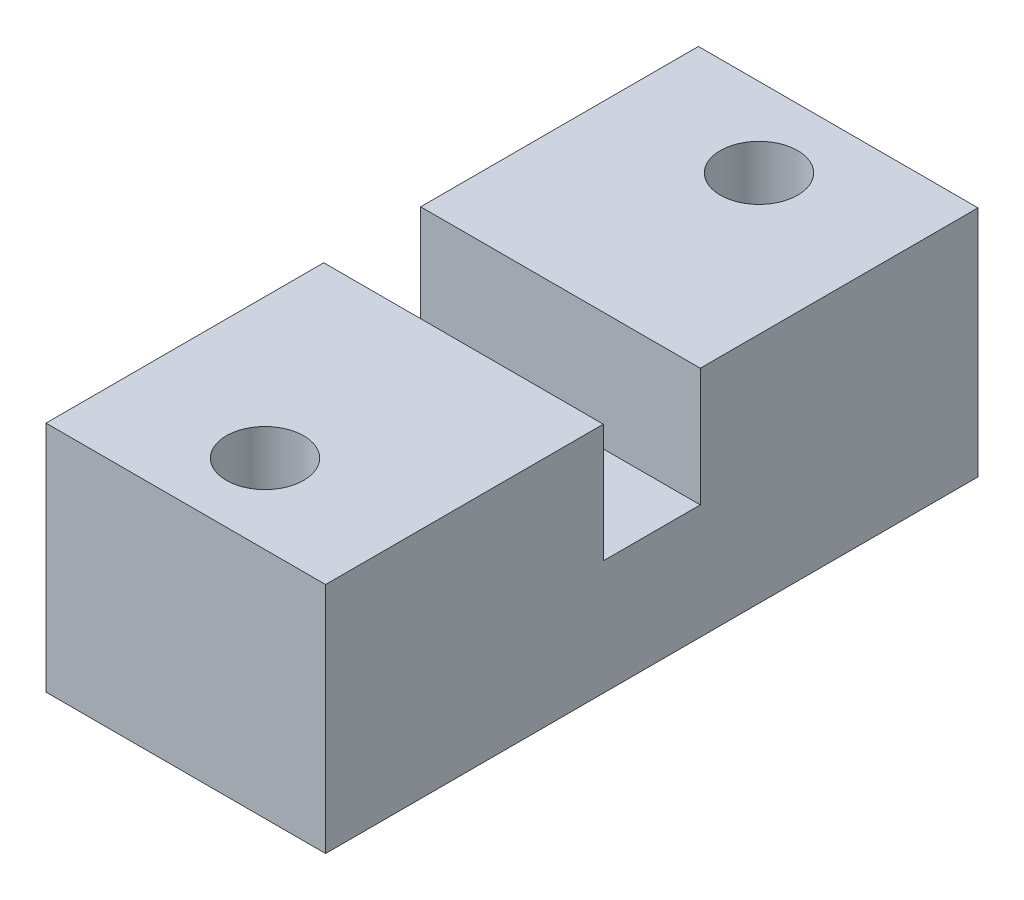
ISO-10303-21;
HEADER;
FILE_DESCRIPTION(('STEP AP214'),'2;1');
FILE_NAME('part.step','',(''),(''),'','','');
FILE_SCHEMA(('AUTOMOTIVE_DESIGN { 1 0 10303 214 1 1 1 1 }'));
ENDSEC;
DATA;
#1=APPLICATION_CONTEXT('core data for automotive mechanical design processes');
#2=APPLICATION_PROTOCOL_DEFINITION('international standard','automotive_design',2000,#1);
#3=PRODUCT_CONTEXT('',#1,'mechanical');
#4=PRODUCT('Part','Part','',(#3));
#5=PRODUCT_RELATED_PRODUCT_CATEGORY('part','',(#4));
#6=PRODUCT_DEFINITION_FORMATION('','',#4);
#7=PRODUCT_DEFINITION_CONTEXT('part definition',#1,'design');
#8=PRODUCT_DEFINITION('design','',#6,#7);
#9=PRODUCT_DEFINITION_SHAPE('','',#8);
#10=(LENGTH_UNIT() NAMED_UNIT(*) SI_UNIT(.MILLI.,.METRE.));
#11=(NAMED_UNIT(*) PLANE_ANGLE_UNIT() SI_UNIT($,.RADIAN.));
#12=(NAMED_UNIT(*) SI_UNIT($,.STERADIAN.) SOLID_ANGLE_UNIT());
#13=UNCERTAINTY_MEASURE_WITH_UNIT(LENGTH_MEASURE(1.E-05),#10,'distance_accuracy_value','');
#14=(GEOMETRIC_REPRESENTATION_CONTEXT(3) GLOBAL_UNCERTAINTY_ASSIGNED_CONTEXT((#13)) GLOBAL_UNIT_ASSIGNED_CONTEXT((#10,
#11,#12)) REPRESENTATION_CONTEXT('',''));
#15=CARTESIAN_POINT('',(0.,0.,0.));
#16=DIRECTION('',(0.,0.,1.));
#17=DIRECTION('',(1.,0.,0.));
#18=AXIS2_PLACEMENT_3D('',#15,#16,#17);
#19=CARTESIAN_POINT('',(0.,25.,0.));
#20=DIRECTION('',(0.,1.,0.));
#21=DIRECTION('',(0.,0.,1.));
#22=AXIS2_PLACEMENT_3D('',#19,#20,#21);
#23=PLANE('',#22);
#24=CARTESIAN_POINT('',(0.,25.,-26.5));
#25=DIRECTION('',(0.,1.,0.));
#26=DIRECTION('',(0.,0.,1.));
#27=AXIS2_PLACEMENT_3D('',#24,#25,#26);
#28=CIRCLE('',#27,4.15);
#29=CARTESIAN_POINT('',(0.,25.,-22.35));
#30=VERTEX_POINT('',#29);
#31=EDGE_CURVE('E200',#30,#30,#28,.T.);
#32=ORIENTED_EDGE('',*,*,#31,.F.);
#33=EDGE_LOOP('',(#32));
#34=FACE_BOUND('',#33,.T.);
#35=DIRECTION('',(-1.,0.,0.));
#36=VECTOR('',#35,1.);
#37=CARTESIAN_POINT('',(15.,25.,-5.2));
#38=LINE('',#37,#36);
#39=CARTESIAN_POINT('',(15.,25.,-5.2));
#40=VERTEX_POINT('',#39);
#41=CARTESIAN_POINT('',(-15.,25.,-5.2));
#42=VERTEX_POINT('',#41);
#43=EDGE_CURVE('E124',#40,#42,#38,.T.);
#44=ORIENTED_EDGE('',*,*,#43,.F.);
#45=DIRECTION('',(0.,0.,-1.));
#46=VECTOR('',#45,1.);
#47=CARTESIAN_POINT('',(15.,25.,35.));
#48=LINE('',#47,#46);
#49=CARTESIAN_POINT('',(15.,25.,-35.));
#50=VERTEX_POINT('',#49);
#51=EDGE_CURVE('E138',#40,#50,#48,.T.);
#52=ORIENTED_EDGE('',*,*,#51,.T.);
#53=DIRECTION('',(-1.,0.,0.));
#54=VECTOR('',#53,1.);
#55=CARTESIAN_POINT('',(15.,25.,-35.));
#56=LINE('',#55,#54);
#57=CARTESIAN_POINT('',(-15.,25.,-35.));
#58=VERTEX_POINT('',#57);
#59=EDGE_CURVE('E58',#50,#58,#56,.T.);
#60=ORIENTED_EDGE('',*,*,#59,.T.);
#61=DIRECTION('',(0.,0.,1.));
#62=VECTOR('',#61,1.);
#63=CARTESIAN_POINT('',(-15.,25.,35.));
#64=LINE('',#63,#62);
#65=EDGE_CURVE('E134',#58,#42,#64,.T.);
#66=ORIENTED_EDGE('',*,*,#65,.T.);
#67=EDGE_LOOP('',(#44,#52,#60,#66));
#68=FACE_BOUND('',#67,.T.);
#69=ADVANCED_FACE('F34',(#34,#68),#23,.T.);
#70=CARTESIAN_POINT('',(-15.,25.,35.));
#71=DIRECTION('',(1.,0.,0.));
#72=DIRECTION('',(0.,0.,-1.));
#73=AXIS2_PLACEMENT_3D('',#70,#71,#72);
#74=PLANE('',#73);
#75=DIRECTION('',(0.,0.,1.));
#76=VECTOR('',#75,1.);
#77=CARTESIAN_POINT('',(-15.,12.3,5.2));
#78=LINE('',#77,#76);
#79=CARTESIAN_POINT('',(-15.,12.3,-5.2));
#80=VERTEX_POINT('',#79);
#81=CARTESIAN_POINT('',(-15.,12.3,5.2));
#82=VERTEX_POINT('',#81);
#83=EDGE_CURVE('E115',#80,#82,#78,.T.);
#84=ORIENTED_EDGE('',*,*,#83,.F.);
#85=DIRECTION('',(0.,1.,0.));
#86=VECTOR('',#85,1.);
#87=CARTESIAN_POINT('',(-15.,12.3,-5.2));
#88=LINE('',#87,#86);
#89=EDGE_CURVE('E148',#80,#42,#88,.T.);
#90=ORIENTED_EDGE('',*,*,#89,.T.);
#91=ORIENTED_EDGE('',*,*,#65,.F.);
#92=DIRECTION('',(0.,-1.,0.));
#93=VECTOR('',#92,1.);
#94=CARTESIAN_POINT('',(-15.,25.,-35.));
#95=LINE('',#94,#93);
#96=CARTESIAN_POINT('',(-15.,0.,-35.));
#97=VERTEX_POINT('',#96);
#98=EDGE_CURVE('E143',#58,#97,#95,.T.);
#99=ORIENTED_EDGE('',*,*,#98,.T.);
#100=DIRECTION('',(0.,0.,1.));
#101=VECTOR('',#100,1.);
#102=CARTESIAN_POINT('',(-15.,0.,35.));
#103=LINE('',#102,#101);
#104=CARTESIAN_POINT('',(-15.,0.,35.));
#105=VERTEX_POINT('',#104);
#106=EDGE_CURVE('E144',#97,#105,#103,.T.);
#107=ORIENTED_EDGE('',*,*,#106,.T.);
#108=DIRECTION('',(0.,-1.,0.));
#109=VECTOR('',#108,1.);
#110=CARTESIAN_POINT('',(-15.,25.,35.));
#111=LINE('',#110,#109);
#112=CARTESIAN_POINT('',(-15.,25.,35.));
#113=VERTEX_POINT('',#112);
#114=EDGE_CURVE('E159',#113,#105,#111,.T.);
#115=ORIENTED_EDGE('',*,*,#114,.F.);
#116=CARTESIAN_POINT('',(-15.,25.,5.2));
#117=VERTEX_POINT('',#116);
#118=EDGE_CURVE('E86',#117,#113,#64,.T.);
#119=ORIENTED_EDGE('',*,*,#118,.F.);
#120=DIRECTION('',(0.,1.,0.));
#121=VECTOR('',#120,1.);
#122=CARTESIAN_POINT('',(-15.,12.3,5.2));
#123=LINE('',#122,#121);
#124=EDGE_CURVE('E49',#82,#117,#123,.T.);
#125=ORIENTED_EDGE('',*,*,#124,.F.);
#126=EDGE_LOOP('',(#84,#90,#91,#99,#107,#115,#119,#125));
#127=FACE_BOUND('',#126,.T.);
#128=ADVANCED_FACE('F126',(#127),#74,.F.);
#129=CARTESIAN_POINT('',(15.,25.,35.));
#130=DIRECTION('',(0.,0.,-1.));
#131=DIRECTION('',(-1.,0.,0.));
#132=AXIS2_PLACEMENT_3D('',#129,#130,#131);
#133=PLANE('',#132);
#134=DIRECTION('',(1.,0.,0.));
#135=VECTOR('',#134,1.);
#136=CARTESIAN_POINT('',(15.,0.,35.));
#137=LINE('',#136,#135);
#138=CARTESIAN_POINT('',(15.,0.,35.));
#139=VERTEX_POINT('',#138);
#140=EDGE_CURVE('E147',#105,#139,#137,.T.);
#141=ORIENTED_EDGE('',*,*,#140,.T.);
#142=DIRECTION('',(0.,-1.,0.));
#143=VECTOR('',#142,1.);
#144=CARTESIAN_POINT('',(15.,25.,35.));
#145=LINE('',#144,#143);
#146=CARTESIAN_POINT('',(15.,25.,35.));
#147=VERTEX_POINT('',#146);
#148=EDGE_CURVE('E156',#147,#139,#145,.T.);
#149=ORIENTED_EDGE('',*,*,#148,.F.);
#150=DIRECTION('',(1.,0.,0.));
#151=VECTOR('',#150,1.);
#152=CARTESIAN_POINT('',(15.,25.,35.));
#153=LINE('',#152,#151);
#154=EDGE_CURVE('E136',#113,#147,#153,.T.);
#155=ORIENTED_EDGE('',*,*,#154,.F.);
#156=ORIENTED_EDGE('',*,*,#114,.T.);
#157=EDGE_LOOP('',(#141,#149,#155,#156));
#158=FACE_BOUND('',#157,.T.);
#159=ADVANCED_FACE('F198',(#158),#133,.F.);
#160=CARTESIAN_POINT('',(15.,25.,35.));
#161=DIRECTION('',(-1.,0.,0.));
#162=DIRECTION('',(0.,0.,1.));
#163=AXIS2_PLACEMENT_3D('',#160,#161,#162);
#164=PLANE('',#163);
#165=ORIENTED_EDGE('',*,*,#51,.F.);
#166=DIRECTION('',(0.,1.,0.));
#167=VECTOR('',#166,1.);
#168=CARTESIAN_POINT('',(15.,12.3,-5.2));
#169=LINE('',#168,#167);
#170=CARTESIAN_POINT('',(15.,12.3,-5.2));
#171=VERTEX_POINT('',#170);
#172=EDGE_CURVE('E129',#171,#40,#169,.T.);
#173=ORIENTED_EDGE('',*,*,#172,.F.);
#174=DIRECTION('',(0.,0.,-1.));
#175=VECTOR('',#174,1.);
#176=CARTESIAN_POINT('',(15.,12.3,5.2));
#177=LINE('',#176,#175);
#178=CARTESIAN_POINT('',(15.,12.3,5.2));
#179=VERTEX_POINT('',#178);
#180=EDGE_CURVE('E114',#179,#171,#177,.T.);
#181=ORIENTED_EDGE('',*,*,#180,.F.);
#182=DIRECTION('',(0.,1.,0.));
#183=VECTOR('',#182,1.);
#184=CARTESIAN_POINT('',(15.,12.3,5.2));
#185=LINE('',#184,#183);
#186=CARTESIAN_POINT('',(15.,25.,5.2));
#187=VERTEX_POINT('',#186);
#188=EDGE_CURVE('E111',#179,#187,#185,.T.);
#189=ORIENTED_EDGE('',*,*,#188,.T.);
#190=EDGE_CURVE('E139',#147,#187,#48,.T.);
#191=ORIENTED_EDGE('',*,*,#190,.F.);
#192=ORIENTED_EDGE('',*,*,#148,.T.);
#193=DIRECTION('',(0.,0.,-1.));
#194=VECTOR('',#193,1.);
#195=CARTESIAN_POINT('',(15.,0.,35.));
#196=LINE('',#195,#194);
#197=CARTESIAN_POINT('',(15.,0.,-35.));
#198=VERTEX_POINT('',#197);
#199=EDGE_CURVE('E150',#139,#198,#196,.T.);
#200=ORIENTED_EDGE('',*,*,#199,.T.);
#201=DIRECTION('',(0.,-1.,0.));
#202=VECTOR('',#201,1.);
#203=CARTESIAN_POINT('',(15.,25.,-35.));
#204=LINE('',#203,#202);
#205=EDGE_CURVE('E154',#50,#198,#204,.T.);
#206=ORIENTED_EDGE('',*,*,#205,.F.);
#207=EDGE_LOOP('',(#165,#173,#181,#189,#191,#192,#200,#206));
#208=FACE_BOUND('',#207,.T.);
#209=ADVANCED_FACE('F193',(#208),#164,.F.);
#210=CARTESIAN_POINT('',(15.,25.,-35.));
#211=DIRECTION('',(0.,0.,1.));
#212=DIRECTION('',(1.,0.,0.));
#213=AXIS2_PLACEMENT_3D('',#210,#211,#212);
#214=PLANE('',#213);
#215=DIRECTION('',(-1.,0.,0.));
#216=VECTOR('',#215,1.);
#217=CARTESIAN_POINT('',(15.,0.,-35.));
#218=LINE('',#217,#216);
#219=EDGE_CURVE('E79',#198,#97,#218,.T.);
#220=ORIENTED_EDGE('',*,*,#219,.T.);
#221=ORIENTED_EDGE('',*,*,#98,.F.);
#222=ORIENTED_EDGE('',*,*,#59,.F.);
#223=ORIENTED_EDGE('',*,*,#205,.T.);
#224=EDGE_LOOP('',(#220,#221,#222,#223));
#225=FACE_BOUND('',#224,.T.);
#226=ADVANCED_FACE('F189',(#225),#214,.F.);
#227=CARTESIAN_POINT('',(0.,25.,26.5));
#228=DIRECTION('',(0.,1.,0.));
#229=DIRECTION('',(0.,0.,1.));
#230=AXIS2_PLACEMENT_3D('',#227,#228,#229);
#231=CIRCLE('',#230,4.15);
#232=CARTESIAN_POINT('',(0.,25.,30.65));
#233=VERTEX_POINT('',#232);
#234=EDGE_CURVE('E204',#233,#233,#231,.T.);
#235=ORIENTED_EDGE('',*,*,#234,.F.);
#236=EDGE_LOOP('',(#235));
#237=FACE_BOUND('',#236,.T.);
#238=DIRECTION('',(1.,0.,0.));
#239=VECTOR('',#238,1.);
#240=CARTESIAN_POINT('',(15.,25.,5.2));
#241=LINE('',#240,#239);
#242=EDGE_CURVE('E199',#117,#187,#241,.T.);
#243=ORIENTED_EDGE('',*,*,#242,.F.);
#244=ORIENTED_EDGE('',*,*,#118,.T.);
#245=ORIENTED_EDGE('',*,*,#154,.T.);
#246=ORIENTED_EDGE('',*,*,#190,.T.);
#247=EDGE_LOOP('',(#243,#244,#245,#246));
#248=FACE_BOUND('',#247,.T.);
#249=ADVANCED_FACE('F182',(#237,#248),#23,.T.);
#250=CARTESIAN_POINT('',(0.,0.,0.));
#251=DIRECTION('',(0.,1.,0.));
#252=DIRECTION('',(0.,0.,1.));
#253=AXIS2_PLACEMENT_3D('',#250,#251,#252);
#254=PLANE('',#253);
#255=CARTESIAN_POINT('',(0.,0.,26.5));
#256=DIRECTION('',(0.,1.,0.));
#257=DIRECTION('',(0.,0.,1.));
#258=AXIS2_PLACEMENT_3D('',#255,#256,#257);
#259=CIRCLE('',#258,5.34175359259421);
#260=CARTESIAN_POINT('',(0.,0.,31.8417535925942));
#261=VERTEX_POINT('',#260);
#262=EDGE_CURVE('E165',#261,#261,#259,.T.);
#263=ORIENTED_EDGE('',*,*,#262,.T.);
#264=EDGE_LOOP('',(#263));
#265=FACE_BOUND('',#264,.T.);
#266=CARTESIAN_POINT('',(0.,0.,-26.5));
#267=DIRECTION('',(0.,1.,0.));
#268=DIRECTION('',(0.,0.,1.));
#269=AXIS2_PLACEMENT_3D('',#266,#267,#268);
#270=CIRCLE('',#269,5.3417535925942);
#271=CARTESIAN_POINT('',(0.,0.,-21.1582464074058));
#272=VERTEX_POINT('',#271);
#273=EDGE_CURVE('E162',#272,#272,#270,.T.);
#274=ORIENTED_EDGE('',*,*,#273,.T.);
#275=EDGE_LOOP('',(#274));
#276=FACE_BOUND('',#275,.T.);
#277=ORIENTED_EDGE('',*,*,#106,.F.);
#278=ORIENTED_EDGE('',*,*,#219,.F.);
#279=ORIENTED_EDGE('',*,*,#199,.F.);
#280=ORIENTED_EDGE('',*,*,#140,.F.);
#281=EDGE_LOOP('',(#277,#278,#279,#280));
#282=FACE_BOUND('',#281,.T.);
#283=ADVANCED_FACE('F178',(#265,#276,#282),#254,.F.);
#284=CARTESIAN_POINT('',(15.,12.3,-5.2));
#285=DIRECTION('',(0.,0.,-1.));
#286=DIRECTION('',(-1.,0.,0.));
#287=AXIS2_PLACEMENT_3D('',#284,#285,#286);
#288=PLANE('',#287);
#289=ORIENTED_EDGE('',*,*,#43,.T.);
#290=ORIENTED_EDGE('',*,*,#89,.F.);
#291=DIRECTION('',(-1.,0.,0.));
#292=VECTOR('',#291,1.);
#293=CARTESIAN_POINT('',(15.,12.3,-5.2));
#294=LINE('',#293,#292);
#295=EDGE_CURVE('E121',#171,#80,#294,.T.);
#296=ORIENTED_EDGE('',*,*,#295,.F.);
#297=ORIENTED_EDGE('',*,*,#172,.T.);
#298=EDGE_LOOP('',(#289,#290,#296,#297));
#299=FACE_BOUND('',#298,.T.);
#300=ADVANCED_FACE('F181',(#299),#288,.F.);
#301=CARTESIAN_POINT('',(15.,12.3,5.2));
#302=DIRECTION('',(0.,0.,1.));
#303=DIRECTION('',(1.,0.,0.));
#304=AXIS2_PLACEMENT_3D('',#301,#302,#303);
#305=PLANE('',#304);
#306=ORIENTED_EDGE('',*,*,#242,.T.);
#307=ORIENTED_EDGE('',*,*,#188,.F.);
#308=DIRECTION('',(1.,0.,0.));
#309=VECTOR('',#308,1.);
#310=CARTESIAN_POINT('',(15.,12.3,5.2));
#311=LINE('',#310,#309);
#312=EDGE_CURVE('E107',#82,#179,#311,.T.);
#313=ORIENTED_EDGE('',*,*,#312,.F.);
#314=ORIENTED_EDGE('',*,*,#124,.T.);
#315=EDGE_LOOP('',(#306,#307,#313,#314));
#316=FACE_BOUND('',#315,.T.);
#317=ADVANCED_FACE('F109',(#316),#305,.F.);
#318=CARTESIAN_POINT('',(0.,12.3,0.));
#319=DIRECTION('',(0.,1.,0.));
#320=DIRECTION('',(0.,0.,1.));
#321=AXIS2_PLACEMENT_3D('',#318,#319,#320);
#322=PLANE('',#321);
#323=ORIENTED_EDGE('',*,*,#83,.T.);
#324=ORIENTED_EDGE('',*,*,#312,.T.);
#325=ORIENTED_EDGE('',*,*,#180,.T.);
#326=ORIENTED_EDGE('',*,*,#295,.T.);
#327=EDGE_LOOP('',(#323,#324,#325,#326));
#328=FACE_BOUND('',#327,.T.);
#329=ADVANCED_FACE('F119',(#328),#322,.T.);
#330=CARTESIAN_POINT('',(0.,0.,-26.5));
#331=DIRECTION('',(0.,1.,0.));
#332=DIRECTION('',(0.,0.,1.));
#333=AXIS2_PLACEMENT_3D('',#330,#331,#332);
#334=CYLINDRICAL_SURFACE('',#333,4.15);
#335=CARTESIAN_POINT('',(0.,1.00000000000001,-26.5));
#336=DIRECTION('',(0.,1.,0.));
#337=DIRECTION('',(0.,0.,1.));
#338=AXIS2_PLACEMENT_3D('',#335,#336,#337);
#339=CIRCLE('',#338,4.15);
#340=CARTESIAN_POINT('',(0.,1.00000000000001,-22.35));
#341=VERTEX_POINT('',#340);
#342=EDGE_CURVE('E11',#341,#341,#339,.F.);
#343=ORIENTED_EDGE('',*,*,#342,.T.);
#344=EDGE_LOOP('',(#343));
#345=FACE_BOUND('',#344,.T.);
#346=ORIENTED_EDGE('',*,*,#31,.T.);
#347=EDGE_LOOP('',(#346));
#348=FACE_BOUND('',#347,.T.);
#349=ADVANCED_FACE('F229',(#345,#348),#334,.F.);
#350=CARTESIAN_POINT('',(0.,0.,26.5));
#351=DIRECTION('',(0.,1.,0.));
#352=DIRECTION('',(0.,0.,1.));
#353=AXIS2_PLACEMENT_3D('',#350,#351,#352);
#354=CYLINDRICAL_SURFACE('',#353,4.15);
#355=CARTESIAN_POINT('',(0.,1.00000000000001,26.5));
#356=DIRECTION('',(0.,1.,0.));
#357=DIRECTION('',(0.,0.,1.));
#358=AXIS2_PLACEMENT_3D('',#355,#356,#357);
#359=CIRCLE('',#358,4.15);
#360=CARTESIAN_POINT('',(0.,1.00000000000001,30.65));
#361=VERTEX_POINT('',#360);
#362=EDGE_CURVE('E42',#361,#361,#359,.F.);
#363=ORIENTED_EDGE('',*,*,#362,.T.);
#364=EDGE_LOOP('',(#363));
#365=FACE_BOUND('',#364,.T.);
#366=ORIENTED_EDGE('',*,*,#234,.T.);
#367=EDGE_LOOP('',(#366));
#368=FACE_BOUND('',#367,.T.);
#369=ADVANCED_FACE('F170',(#365,#368),#354,.F.);
#370=CARTESIAN_POINT('',(0.,0.,26.5));
#371=DIRECTION('',(0.,-1.,0.));
#372=DIRECTION('',(0.,0.,-1.));
#373=AXIS2_PLACEMENT_3D('',#370,#371,#372);
#374=CONICAL_SURFACE('',#373,5.34175359259421,0.87266462599716);
#375=ORIENTED_EDGE('',*,*,#362,.F.);
#376=EDGE_LOOP('',(#375));
#377=FACE_BOUND('',#376,.T.);
#378=ORIENTED_EDGE('',*,*,#262,.F.);
#379=EDGE_LOOP('',(#378));
#380=FACE_BOUND('',#379,.T.);
#381=ADVANCED_FACE('F173',(#377,#380),#374,.F.);
#382=CARTESIAN_POINT('',(0.,0.,-26.5));
#383=DIRECTION('',(0.,-1.,0.));
#384=DIRECTION('',(0.,0.,-1.));
#385=AXIS2_PLACEMENT_3D('',#382,#383,#384);
#386=CONICAL_SURFACE('',#385,5.3417535925942,0.872664625997157);
#387=ORIENTED_EDGE('',*,*,#342,.F.);
#388=EDGE_LOOP('',(#387));
#389=FACE_BOUND('',#388,.T.);
#390=ORIENTED_EDGE('',*,*,#273,.F.);
#391=EDGE_LOOP('',(#390));
#392=FACE_BOUND('',#391,.T.);
#393=ADVANCED_FACE('F36',(#389,#392),#386,.F.);
#394=CLOSED_SHELL('',(#69,#128,#159,#209,#226,#249,#283,#300,#317,#329,#349,#369,#381,#393));
#395=MANIFOLD_SOLID_BREP('B2',#394);
#396=ADVANCED_BREP_SHAPE_REPRESENTATION('',(#18,#395),#14);
#397=SHAPE_DEFINITION_REPRESENTATION(#9,#396);
ENDSEC;
END-ISO-10303-21;
